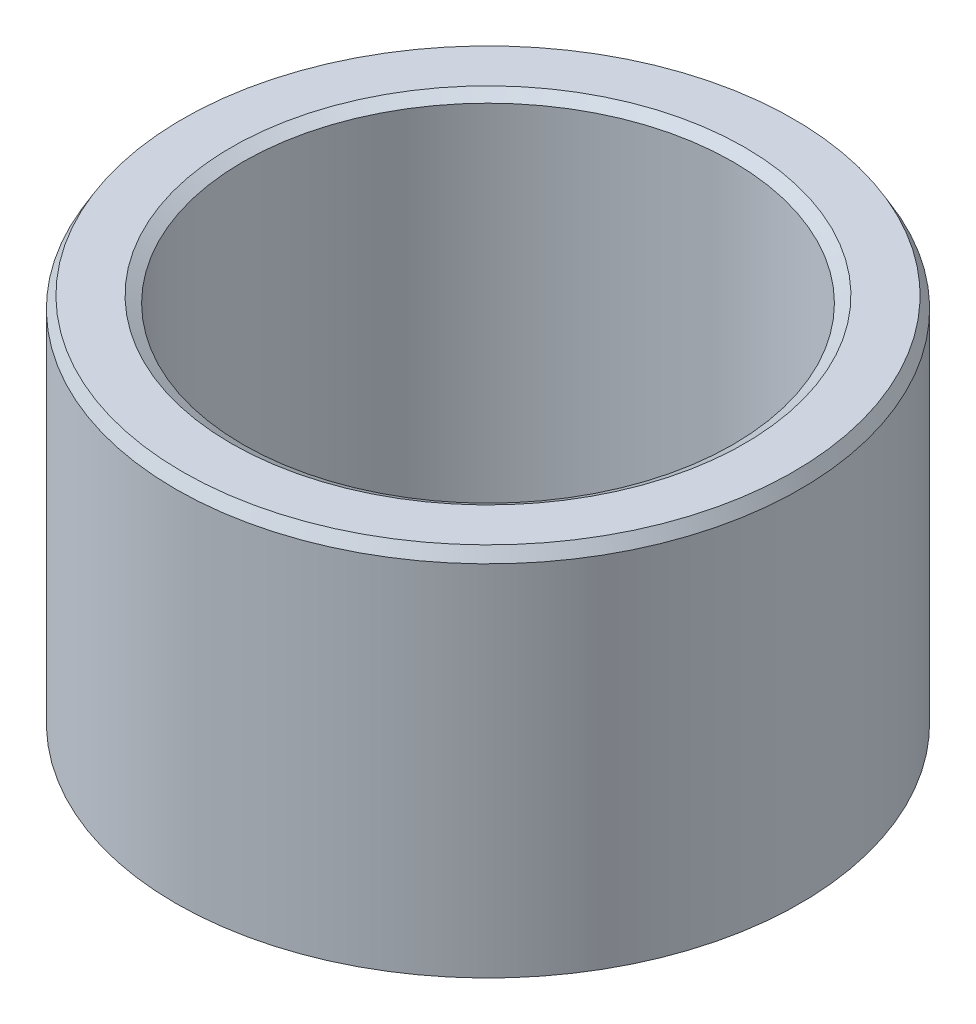
ISO-10303-21;
HEADER;
FILE_DESCRIPTION(('STEP AP214'),'2;1');
FILE_NAME('part.step','',(''),(''),'','','');
FILE_SCHEMA(('AUTOMOTIVE_DESIGN { 1 0 10303 214 1 1 1 1 }'));
ENDSEC;
DATA;
#1=APPLICATION_CONTEXT('core data for automotive mechanical design processes');
#2=APPLICATION_PROTOCOL_DEFINITION('international standard','automotive_design',2000,#1);
#3=PRODUCT_CONTEXT('',#1,'mechanical');
#4=PRODUCT('Part','Part','',(#3));
#5=PRODUCT_RELATED_PRODUCT_CATEGORY('part','',(#4));
#6=PRODUCT_DEFINITION_FORMATION('','',#4);
#7=PRODUCT_DEFINITION_CONTEXT('part definition',#1,'design');
#8=PRODUCT_DEFINITION('design','',#6,#7);
#9=PRODUCT_DEFINITION_SHAPE('','',#8);
#10=(LENGTH_UNIT() NAMED_UNIT(*) SI_UNIT(.MILLI.,.METRE.));
#11=(NAMED_UNIT(*) PLANE_ANGLE_UNIT() SI_UNIT($,.RADIAN.));
#12=(NAMED_UNIT(*) SI_UNIT($,.STERADIAN.) SOLID_ANGLE_UNIT());
#13=UNCERTAINTY_MEASURE_WITH_UNIT(LENGTH_MEASURE(1.E-05),#10,'distance_accuracy_value','');
#14=(GEOMETRIC_REPRESENTATION_CONTEXT(3) GLOBAL_UNCERTAINTY_ASSIGNED_CONTEXT((#13)) GLOBAL_UNIT_ASSIGNED_CONTEXT((#10,
#11,#12)) REPRESENTATION_CONTEXT('',''));
#15=CARTESIAN_POINT('',(0.,0.,0.));
#16=DIRECTION('',(0.,0.,1.));
#17=DIRECTION('',(1.,0.,0.));
#18=AXIS2_PLACEMENT_3D('',#15,#16,#17);
#19=CARTESIAN_POINT('',(0.,72.4520186251469,0.));
#20=DIRECTION('',(0.,-1.,0.));
#21=DIRECTION('',(0.,0.,-1.));
#22=AXIS2_PLACEMENT_3D('',#19,#20,#21);
#23=CYLINDRICAL_SURFACE('',#22,60.);
#24=CARTESIAN_POINT('',(0.,1.29622966714091,0.));
#25=DIRECTION('',(0.,1.,0.));
#26=DIRECTION('',(0.,0.,1.));
#27=AXIS2_PLACEMENT_3D('',#24,#25,#26);
#28=CIRCLE('',#27,60.);
#29=CARTESIAN_POINT('',(0.,1.29622966714091,60.));
#30=VERTEX_POINT('',#29);
#31=EDGE_CURVE('E10',#30,#30,#28,.T.);
#32=ORIENTED_EDGE('',*,*,#31,.T.);
#33=EDGE_LOOP('',(#32));
#34=FACE_BOUND('',#33,.T.);
#35=CARTESIAN_POINT('',(0.,70.2068829833808,0.));
#36=DIRECTION('',(0.,1.,0.));
#37=DIRECTION('',(0.,0.,1.));
#38=AXIS2_PLACEMENT_3D('',#35,#36,#37);
#39=CIRCLE('',#38,60.);
#40=CARTESIAN_POINT('',(0.,70.2068829833808,60.));
#41=VERTEX_POINT('',#40);
#42=EDGE_CURVE('E50',#41,#41,#39,.F.);
#43=ORIENTED_EDGE('',*,*,#42,.T.);
#44=EDGE_LOOP('',(#43));
#45=FACE_BOUND('',#44,.T.);
#46=ADVANCED_FACE('F39',(#34,#45),#23,.T.);
#47=CARTESIAN_POINT('',(0.,72.4520186251469,0.));
#48=DIRECTION('',(0.,1.,0.));
#49=DIRECTION('',(0.,0.,1.));
#50=AXIS2_PLACEMENT_3D('',#47,#48,#49);
#51=PLANE('',#50);
#52=CARTESIAN_POINT('',(0.,72.4520186251469,0.));
#53=DIRECTION('',(0.,1.,0.));
#54=DIRECTION('',(0.,0.,1.));
#55=AXIS2_PLACEMENT_3D('',#52,#53,#54);
#56=CIRCLE('',#55,49.3081731316076);
#57=CARTESIAN_POINT('',(0.,72.4520186251469,49.3081731316076));
#58=VERTEX_POINT('',#57);
#59=EDGE_CURVE('E58',#58,#58,#56,.F.);
#60=ORIENTED_EDGE('',*,*,#59,.T.);
#61=EDGE_LOOP('',(#60));
#62=FACE_BOUND('',#61,.T.);
#63=CARTESIAN_POINT('',(0.,72.4520186251469,0.));
#64=DIRECTION('',(0.,1.,0.));
#65=DIRECTION('',(0.,0.,1.));
#66=AXIS2_PLACEMENT_3D('',#63,#64,#65);
#67=CIRCLE('',#66,58.7037703328591);
#68=CARTESIAN_POINT('',(0.,72.4520186251469,58.7037703328591));
#69=VERTEX_POINT('',#68);
#70=EDGE_CURVE('E61',#69,#69,#67,.T.);
#71=ORIENTED_EDGE('',*,*,#70,.T.);
#72=EDGE_LOOP('',(#71));
#73=FACE_BOUND('',#72,.T.);
#74=ADVANCED_FACE('F88',(#62,#73),#51,.T.);
#75=CARTESIAN_POINT('',(0.,0.,0.));
#76=DIRECTION('',(0.,1.,0.));
#77=DIRECTION('',(0.,0.,1.));
#78=AXIS2_PLACEMENT_3D('',#75,#76,#77);
#79=PLANE('',#78);
#80=CARTESIAN_POINT('',(0.,0.,0.));
#81=DIRECTION('',(0.,1.,0.));
#82=DIRECTION('',(0.,0.,1.));
#83=AXIS2_PLACEMENT_3D('',#80,#81,#82);
#84=CIRCLE('',#83,48.3592671569823);
#85=CARTESIAN_POINT('',(0.,0.,48.3592671569823));
#86=VERTEX_POINT('',#85);
#87=EDGE_CURVE('E51',#86,#86,#84,.T.);
#88=ORIENTED_EDGE('',*,*,#87,.T.);
#89=EDGE_LOOP('',(#88));
#90=FACE_BOUND('',#89,.T.);
#91=CARTESIAN_POINT('',(0.,0.,0.));
#92=DIRECTION('',(0.,1.,0.));
#93=DIRECTION('',(0.,0.,1.));
#94=AXIS2_PLACEMENT_3D('',#91,#92,#93);
#95=CIRCLE('',#94,57.7548643582339);
#96=CARTESIAN_POINT('',(0.,0.,57.7548643582339));
#97=VERTEX_POINT('',#96);
#98=EDGE_CURVE('E54',#97,#97,#95,.F.);
#99=ORIENTED_EDGE('',*,*,#98,.T.);
#100=EDGE_LOOP('',(#99));
#101=FACE_BOUND('',#100,.T.);
#102=ADVANCED_FACE('F83',(#90,#101),#79,.F.);
#103=CARTESIAN_POINT('',(0.,72.4520186251469,0.));
#104=DIRECTION('',(0.,-1.,0.));
#105=DIRECTION('',(0.,0.,-1.));
#106=AXIS2_PLACEMENT_3D('',#103,#104,#105);
#107=CYLINDRICAL_SURFACE('',#106,47.0630374898414);
#108=CARTESIAN_POINT('',(0.,71.155788958006,0.));
#109=DIRECTION('',(0.,1.,0.));
#110=DIRECTION('',(0.,0.,1.));
#111=AXIS2_PLACEMENT_3D('',#108,#109,#110);
#112=CIRCLE('',#111,47.0630374898414);
#113=CARTESIAN_POINT('',(0.,71.155788958006,47.0630374898414));
#114=VERTEX_POINT('',#113);
#115=EDGE_CURVE('E67',#114,#114,#112,.T.);
#116=ORIENTED_EDGE('',*,*,#115,.T.);
#117=EDGE_LOOP('',(#116));
#118=FACE_BOUND('',#117,.T.);
#119=CARTESIAN_POINT('',(0.,2.24513564176612,0.));
#120=DIRECTION('',(0.,1.,0.));
#121=DIRECTION('',(0.,0.,1.));
#122=AXIS2_PLACEMENT_3D('',#119,#120,#121);
#123=CIRCLE('',#122,47.0630374898414);
#124=CARTESIAN_POINT('',(0.,2.24513564176612,47.0630374898414));
#125=VERTEX_POINT('',#124);
#126=EDGE_CURVE('E69',#125,#125,#123,.F.);
#127=ORIENTED_EDGE('',*,*,#126,.T.);
#128=EDGE_LOOP('',(#127));
#129=FACE_BOUND('',#128,.T.);
#130=ADVANCED_FACE('F71',(#118,#129),#107,.F.);
#131=CARTESIAN_POINT('',(0.,71.155788958006,0.));
#132=DIRECTION('',(0.,1.,0.));
#133=DIRECTION('',(0.,0.,1.));
#134=AXIS2_PLACEMENT_3D('',#131,#132,#133);
#135=CONICAL_SURFACE('',#134,47.0630374898414,1.04719755119661);
#136=ORIENTED_EDGE('',*,*,#59,.F.);
#137=EDGE_LOOP('',(#136));
#138=FACE_BOUND('',#137,.T.);
#139=ORIENTED_EDGE('',*,*,#115,.F.);
#140=EDGE_LOOP('',(#139));
#141=FACE_BOUND('',#140,.T.);
#142=ADVANCED_FACE('F77',(#138,#141),#135,.F.);
#143=CARTESIAN_POINT('',(0.,0.,0.));
#144=DIRECTION('',(0.,-1.,0.));
#145=DIRECTION('',(0.,0.,-1.));
#146=AXIS2_PLACEMENT_3D('',#143,#144,#145);
#147=CONICAL_SURFACE('',#146,48.3592671569823,0.523598775598294);
#148=ORIENTED_EDGE('',*,*,#126,.F.);
#149=EDGE_LOOP('',(#148));
#150=FACE_BOUND('',#149,.T.);
#151=ORIENTED_EDGE('',*,*,#87,.F.);
#152=EDGE_LOOP('',(#151));
#153=FACE_BOUND('',#152,.T.);
#154=ADVANCED_FACE('F73',(#150,#153),#147,.F.);
#155=CARTESIAN_POINT('',(0.,1.29622966714091,0.));
#156=DIRECTION('',(0.,1.,0.));
#157=DIRECTION('',(0.,0.,1.));
#158=AXIS2_PLACEMENT_3D('',#155,#156,#157);
#159=CONICAL_SURFACE('',#158,60.,1.0471975511966);
#160=ORIENTED_EDGE('',*,*,#98,.F.);
#161=EDGE_LOOP('',(#160));
#162=FACE_BOUND('',#161,.T.);
#163=ORIENTED_EDGE('',*,*,#31,.F.);
#164=EDGE_LOOP('',(#163));
#165=FACE_BOUND('',#164,.T.);
#166=ADVANCED_FACE('F76',(#162,#165),#159,.T.);
#167=CARTESIAN_POINT('',(0.,72.4520186251469,0.));
#168=DIRECTION('',(0.,-1.,0.));
#169=DIRECTION('',(0.,0.,-1.));
#170=AXIS2_PLACEMENT_3D('',#167,#168,#169);
#171=CONICAL_SURFACE('',#170,58.7037703328591,0.523598775598296);
#172=ORIENTED_EDGE('',*,*,#42,.F.);
#173=EDGE_LOOP('',(#172));
#174=FACE_BOUND('',#173,.T.);
#175=ORIENTED_EDGE('',*,*,#70,.F.);
#176=EDGE_LOOP('',(#175));
#177=FACE_BOUND('',#176,.T.);
#178=ADVANCED_FACE('F45',(#174,#177),#171,.T.);
#179=CLOSED_SHELL('',(#46,#74,#102,#130,#142,#154,#166,#178));
#180=MANIFOLD_SOLID_BREP('B2',#179);
#181=ADVANCED_BREP_SHAPE_REPRESENTATION('',(#18,#180),#14);
#182=SHAPE_DEFINITION_REPRESENTATION(#9,#181);
ENDSEC;
END-ISO-10303-21;
